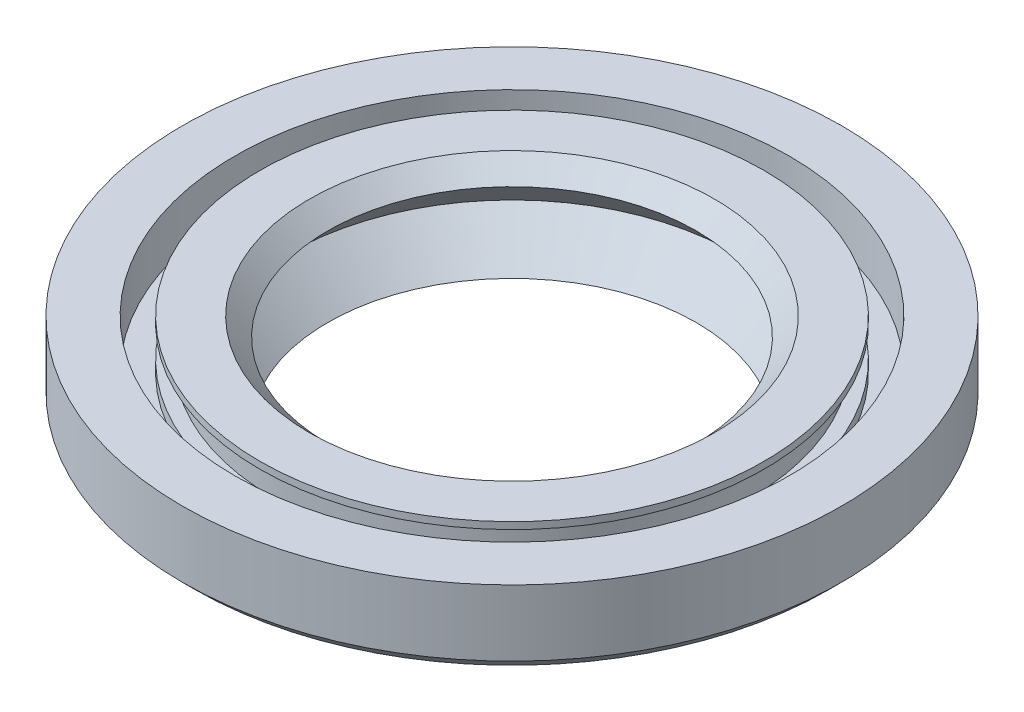
ISO-10303-21;
HEADER;
FILE_DESCRIPTION(('STEP AP214'),'2;1');
FILE_NAME('part.step','',(''),(''),'','','');
FILE_SCHEMA(('AUTOMOTIVE_DESIGN { 1 0 10303 214 1 1 1 1 }'));
ENDSEC;
DATA;
#1=APPLICATION_CONTEXT('core data for automotive mechanical design processes');
#2=APPLICATION_PROTOCOL_DEFINITION('international standard','automotive_design',2000,#1);
#3=PRODUCT_CONTEXT('',#1,'mechanical');
#4=PRODUCT('Part','Part','',(#3));
#5=PRODUCT_RELATED_PRODUCT_CATEGORY('part','',(#4));
#6=PRODUCT_DEFINITION_FORMATION('','',#4);
#7=PRODUCT_DEFINITION_CONTEXT('part definition',#1,'design');
#8=PRODUCT_DEFINITION('design','',#6,#7);
#9=PRODUCT_DEFINITION_SHAPE('','',#8);
#10=(LENGTH_UNIT() NAMED_UNIT(*) SI_UNIT(.MILLI.,.METRE.));
#11=(NAMED_UNIT(*) PLANE_ANGLE_UNIT() SI_UNIT($,.RADIAN.));
#12=(NAMED_UNIT(*) SI_UNIT($,.STERADIAN.) SOLID_ANGLE_UNIT());
#13=UNCERTAINTY_MEASURE_WITH_UNIT(LENGTH_MEASURE(1.E-05),#10,'distance_accuracy_value','');
#14=(GEOMETRIC_REPRESENTATION_CONTEXT(3) GLOBAL_UNCERTAINTY_ASSIGNED_CONTEXT((#13)) GLOBAL_UNIT_ASSIGNED_CONTEXT((#10,
#11,#12)) REPRESENTATION_CONTEXT('',''));
#15=CARTESIAN_POINT('',(0.,0.,0.));
#16=DIRECTION('',(0.,0.,1.));
#17=DIRECTION('',(1.,0.,0.));
#18=AXIS2_PLACEMENT_3D('',#15,#16,#17);
#19=CARTESIAN_POINT('',(0.,-1.22127685235368,0.));
#20=DIRECTION('',(0.,1.,0.));
#21=DIRECTION('',(0.,0.,1.));
#22=AXIS2_PLACEMENT_3D('',#19,#20,#21);
#23=CONICAL_SURFACE('',#22,11.5259526063671,0.774180610663883);
#24=CARTESIAN_POINT('',(0.,-3.29319951889741,0.));
#25=DIRECTION('',(0.,1.,0.));
#26=DIRECTION('',(0.,0.,1.));
#27=AXIS2_PLACEMENT_3D('',#24,#25,#26);
#28=CIRCLE('',#27,9.5);
#29=CARTESIAN_POINT('',(0.,-3.29319951889741,9.5));
#30=VERTEX_POINT('',#29);
#31=EDGE_CURVE('E10',#30,#30,#28,.T.);
#32=ORIENTED_EDGE('',*,*,#31,.F.);
#33=EDGE_LOOP('',(#32));
#34=FACE_BOUND('',#33,.T.);
#35=CARTESIAN_POINT('',(0.,-1.22127685235368,0.));
#36=DIRECTION('',(0.,1.,0.));
#37=DIRECTION('',(0.,0.,1.));
#38=AXIS2_PLACEMENT_3D('',#35,#36,#37);
#39=CIRCLE('',#38,11.5259526063671);
#40=CARTESIAN_POINT('',(0.,-1.22127685235368,11.5259526063671));
#41=VERTEX_POINT('',#40);
#42=EDGE_CURVE('E85',#41,#41,#39,.T.);
#43=ORIENTED_EDGE('',*,*,#42,.T.);
#44=EDGE_LOOP('',(#43));
#45=FACE_BOUND('',#44,.T.);
#46=ADVANCED_FACE('F30',(#34,#45),#23,.F.);
#47=CARTESIAN_POINT('',(0.,-3.29319951889741,0.));
#48=DIRECTION('',(0.,-1.,0.));
#49=DIRECTION('',(0.,0.,-1.));
#50=AXIS2_PLACEMENT_3D('',#47,#48,#49);
#51=CONICAL_SURFACE('',#50,9.5,1.45137891272772);
#52=CARTESIAN_POINT('',(0.,-3.59308306273926,0.));
#53=DIRECTION('',(0.,1.,0.));
#54=DIRECTION('',(0.,0.,1.));
#55=AXIS2_PLACEMENT_3D('',#52,#53,#54);
#56=CIRCLE('',#55,11.9992727468085);
#57=CARTESIAN_POINT('',(0.,-3.59308306273926,11.9992727468085));
#58=VERTEX_POINT('',#57);
#59=EDGE_CURVE('E36',#58,#58,#56,.T.);
#60=ORIENTED_EDGE('',*,*,#59,.F.);
#61=EDGE_LOOP('',(#60));
#62=FACE_BOUND('',#61,.T.);
#63=ORIENTED_EDGE('',*,*,#31,.T.);
#64=EDGE_LOOP('',(#63));
#65=FACE_BOUND('',#64,.T.);
#66=ADVANCED_FACE('F176',(#62,#65),#51,.F.);
#67=CARTESIAN_POINT('',(0.,-3.59308306273926,0.));
#68=DIRECTION('',(0.,1.,0.));
#69=DIRECTION('',(0.,0.,1.));
#70=AXIS2_PLACEMENT_3D('',#67,#68,#69);
#71=CONICAL_SURFACE('',#70,11.9992727468085,1.00720394930274);
#72=CARTESIAN_POINT('',(0.,-2.28382112157988,0.));
#73=DIRECTION('',(0.,1.,0.));
#74=DIRECTION('',(0.,0.,1.));
#75=AXIS2_PLACEMENT_3D('',#72,#73,#74);
#76=CIRCLE('',#75,14.0710035852234);
#77=CARTESIAN_POINT('',(0.,-2.28382112157988,14.0710035852234));
#78=VERTEX_POINT('',#77);
#79=EDGE_CURVE('E40',#78,#78,#76,.T.);
#80=ORIENTED_EDGE('',*,*,#79,.F.);
#81=EDGE_LOOP('',(#80));
#82=FACE_BOUND('',#81,.T.);
#83=ORIENTED_EDGE('',*,*,#59,.T.);
#84=EDGE_LOOP('',(#83));
#85=FACE_BOUND('',#84,.T.);
#86=ADVANCED_FACE('F171',(#82,#85),#71,.T.);
#87=CARTESIAN_POINT('',(16.3705936000076,-2.28382112157987,0.));
#88=DIRECTION('',(0.,1.,0.));
#89=DIRECTION('',(0.,0.,1.));
#90=AXIS2_PLACEMENT_3D('',#87,#88,#89);
#91=PLANE('',#90);
#92=CARTESIAN_POINT('',(0.,-2.28382112157988,0.));
#93=DIRECTION('',(0.,1.,0.));
#94=DIRECTION('',(0.,0.,1.));
#95=AXIS2_PLACEMENT_3D('',#92,#93,#94);
#96=CIRCLE('',#95,16.3705936000076);
#97=CARTESIAN_POINT('',(0.,-2.28382112157988,16.3705936000076));
#98=VERTEX_POINT('',#97);
#99=EDGE_CURVE('E44',#98,#98,#96,.T.);
#100=ORIENTED_EDGE('',*,*,#99,.F.);
#101=EDGE_LOOP('',(#100));
#102=FACE_BOUND('',#101,.T.);
#103=ORIENTED_EDGE('',*,*,#79,.T.);
#104=EDGE_LOOP('',(#103));
#105=FACE_BOUND('',#104,.T.);
#106=ADVANCED_FACE('F165',(#102,#105),#91,.F.);
#107=CARTESIAN_POINT('',(0.,-2.28382112157988,0.));
#108=DIRECTION('',(0.,1.,0.));
#109=DIRECTION('',(0.,0.,1.));
#110=AXIS2_PLACEMENT_3D('',#107,#108,#109);
#111=CONICAL_SURFACE('',#110,16.3705936000076,0.785398163397446);
#112=CARTESIAN_POINT('',(0.,-1.65441472158748,0.));
#113=DIRECTION('',(0.,1.,0.));
#114=DIRECTION('',(0.,0.,1.));
#115=AXIS2_PLACEMENT_3D('',#112,#113,#114);
#116=CIRCLE('',#115,17.);
#117=CARTESIAN_POINT('',(0.,-1.65441472158748,17.));
#118=VERTEX_POINT('',#117);
#119=EDGE_CURVE('E49',#118,#118,#116,.T.);
#120=ORIENTED_EDGE('',*,*,#119,.F.);
#121=EDGE_LOOP('',(#120));
#122=FACE_BOUND('',#121,.T.);
#123=ORIENTED_EDGE('',*,*,#99,.T.);
#124=EDGE_LOOP('',(#123));
#125=FACE_BOUND('',#124,.T.);
#126=ADVANCED_FACE('F159',(#122,#125),#111,.T.);
#127=CARTESIAN_POINT('',(0.,17.2087848331996,0.));
#128=DIRECTION('',(0.,1.,0.));
#129=DIRECTION('',(0.,0.,1.));
#130=AXIS2_PLACEMENT_3D('',#127,#128,#129);
#131=CYLINDRICAL_SURFACE('',#130,17.);
#132=CARTESIAN_POINT('',(0.,1.75029644571561,0.));
#133=DIRECTION('',(0.,1.,0.));
#134=DIRECTION('',(0.,0.,1.));
#135=AXIS2_PLACEMENT_3D('',#132,#133,#134);
#136=CIRCLE('',#135,17.);
#137=CARTESIAN_POINT('',(0.,1.75029644571561,17.));
#138=VERTEX_POINT('',#137);
#139=EDGE_CURVE('E52',#138,#138,#136,.T.);
#140=ORIENTED_EDGE('',*,*,#139,.F.);
#141=EDGE_LOOP('',(#140));
#142=FACE_BOUND('',#141,.T.);
#143=ORIENTED_EDGE('',*,*,#119,.T.);
#144=EDGE_LOOP('',(#143));
#145=FACE_BOUND('',#144,.T.);
#146=ADVANCED_FACE('F153',(#142,#145),#131,.T.);
#147=CARTESIAN_POINT('',(14.2944072960471,1.75029644571561,0.));
#148=DIRECTION('',(0.,-1.,0.));
#149=DIRECTION('',(0.,0.,-1.));
#150=AXIS2_PLACEMENT_3D('',#147,#148,#149);
#151=PLANE('',#150);
#152=CARTESIAN_POINT('',(0.,1.75029644571561,0.));
#153=DIRECTION('',(0.,1.,0.));
#154=DIRECTION('',(0.,0.,1.));
#155=AXIS2_PLACEMENT_3D('',#152,#153,#154);
#156=CIRCLE('',#155,14.2944072960471);
#157=CARTESIAN_POINT('',(0.,1.75029644571561,14.2944072960471));
#158=VERTEX_POINT('',#157);
#159=EDGE_CURVE('E55',#158,#158,#156,.T.);
#160=ORIENTED_EDGE('',*,*,#159,.F.);
#161=EDGE_LOOP('',(#160));
#162=FACE_BOUND('',#161,.T.);
#163=ORIENTED_EDGE('',*,*,#139,.T.);
#164=EDGE_LOOP('',(#163));
#165=FACE_BOUND('',#164,.T.);
#166=ADVANCED_FACE('F147',(#162,#165),#151,.F.);
#167=CARTESIAN_POINT('',(0.,17.2087848331996,0.));
#168=DIRECTION('',(0.,1.,0.));
#169=DIRECTION('',(0.,0.,1.));
#170=AXIS2_PLACEMENT_3D('',#167,#168,#169);
#171=CYLINDRICAL_SURFACE('',#170,14.2944072960471);
#172=CARTESIAN_POINT('',(0.,-0.78508260676553,0.));
#173=DIRECTION('',(0.,1.,0.));
#174=DIRECTION('',(0.,0.,1.));
#175=AXIS2_PLACEMENT_3D('',#172,#173,#174);
#176=CIRCLE('',#175,14.2944072960471);
#177=CARTESIAN_POINT('',(0.,-0.78508260676553,14.2944072960471));
#178=VERTEX_POINT('',#177);
#179=EDGE_CURVE('E58',#178,#178,#176,.T.);
#180=ORIENTED_EDGE('',*,*,#179,.F.);
#181=EDGE_LOOP('',(#180));
#182=FACE_BOUND('',#181,.T.);
#183=ORIENTED_EDGE('',*,*,#159,.T.);
#184=EDGE_LOOP('',(#183));
#185=FACE_BOUND('',#184,.T.);
#186=ADVANCED_FACE('F141',(#182,#185),#171,.F.);
#187=CARTESIAN_POINT('',(13.,-0.78508260676553,0.));
#188=DIRECTION('',(0.,-1.,0.));
#189=DIRECTION('',(0.,0.,-1.));
#190=AXIS2_PLACEMENT_3D('',#187,#188,#189);
#191=PLANE('',#190);
#192=CARTESIAN_POINT('',(0.,-0.78508260676553,0.));
#193=DIRECTION('',(0.,1.,0.));
#194=DIRECTION('',(0.,0.,1.));
#195=AXIS2_PLACEMENT_3D('',#192,#193,#194);
#196=CIRCLE('',#195,13.);
#197=CARTESIAN_POINT('',(0.,-0.78508260676553,13.));
#198=VERTEX_POINT('',#197);
#199=EDGE_CURVE('E61',#198,#198,#196,.T.);
#200=ORIENTED_EDGE('',*,*,#199,.F.);
#201=EDGE_LOOP('',(#200));
#202=FACE_BOUND('',#201,.T.);
#203=ORIENTED_EDGE('',*,*,#179,.T.);
#204=EDGE_LOOP('',(#203));
#205=FACE_BOUND('',#204,.T.);
#206=ADVANCED_FACE('F135',(#202,#205),#191,.F.);
#207=CARTESIAN_POINT('',(0.,17.2087848331996,0.));
#208=DIRECTION('',(0.,1.,0.));
#209=DIRECTION('',(0.,0.,1.));
#210=AXIS2_PLACEMENT_3D('',#207,#208,#209);
#211=CYLINDRICAL_SURFACE('',#210,13.);
#212=CARTESIAN_POINT('',(0.,-0.208300549170145,0.));
#213=DIRECTION('',(0.,1.,0.));
#214=DIRECTION('',(0.,0.,1.));
#215=AXIS2_PLACEMENT_3D('',#212,#213,#214);
#216=CIRCLE('',#215,13.);
#217=CARTESIAN_POINT('',(0.,-0.208300549170145,13.));
#218=VERTEX_POINT('',#217);
#219=EDGE_CURVE('E64',#218,#218,#216,.T.);
#220=ORIENTED_EDGE('',*,*,#219,.F.);
#221=EDGE_LOOP('',(#220));
#222=FACE_BOUND('',#221,.T.);
#223=ORIENTED_EDGE('',*,*,#199,.T.);
#224=EDGE_LOOP('',(#223));
#225=FACE_BOUND('',#224,.T.);
#226=ADVANCED_FACE('F129',(#222,#225),#211,.T.);
#227=CARTESIAN_POINT('',(12.3164572927732,-0.208300549170146,0.));
#228=DIRECTION('',(0.,-1.,0.));
#229=DIRECTION('',(0.,0.,-1.));
#230=AXIS2_PLACEMENT_3D('',#227,#228,#229);
#231=PLANE('',#230);
#232=CARTESIAN_POINT('',(0.,-0.208300549170145,0.));
#233=DIRECTION('',(0.,1.,0.));
#234=DIRECTION('',(0.,0.,1.));
#235=AXIS2_PLACEMENT_3D('',#232,#233,#234);
#236=CIRCLE('',#235,12.3164572927732);
#237=CARTESIAN_POINT('',(0.,-0.208300549170145,12.3164572927732));
#238=VERTEX_POINT('',#237);
#239=EDGE_CURVE('E67',#238,#238,#236,.T.);
#240=ORIENTED_EDGE('',*,*,#239,.F.);
#241=EDGE_LOOP('',(#240));
#242=FACE_BOUND('',#241,.T.);
#243=ORIENTED_EDGE('',*,*,#219,.T.);
#244=EDGE_LOOP('',(#243));
#245=FACE_BOUND('',#244,.T.);
#246=ADVANCED_FACE('F123',(#242,#245),#231,.F.);
#247=CARTESIAN_POINT('',(0.,17.2087848331996,0.));
#248=DIRECTION('',(0.,1.,0.));
#249=DIRECTION('',(0.,0.,1.));
#250=AXIS2_PLACEMENT_3D('',#247,#248,#249);
#251=CYLINDRICAL_SURFACE('',#250,12.3164572927732);
#252=CARTESIAN_POINT('',(0.,1.39588862117523,0.));
#253=DIRECTION('',(0.,1.,0.));
#254=DIRECTION('',(0.,0.,1.));
#255=AXIS2_PLACEMENT_3D('',#252,#253,#254);
#256=CIRCLE('',#255,12.3164572927732);
#257=CARTESIAN_POINT('',(0.,1.39588862117523,12.3164572927732));
#258=VERTEX_POINT('',#257);
#259=EDGE_CURVE('E70',#258,#258,#256,.T.);
#260=ORIENTED_EDGE('',*,*,#259,.F.);
#261=EDGE_LOOP('',(#260));
#262=FACE_BOUND('',#261,.T.);
#263=ORIENTED_EDGE('',*,*,#239,.T.);
#264=EDGE_LOOP('',(#263));
#265=FACE_BOUND('',#264,.T.);
#266=ADVANCED_FACE('F117',(#262,#265),#251,.T.);
#267=CARTESIAN_POINT('',(13.,1.39588862117524,0.));
#268=DIRECTION('',(0.,1.,0.));
#269=DIRECTION('',(0.,0.,1.));
#270=AXIS2_PLACEMENT_3D('',#267,#268,#269);
#271=PLANE('',#270);
#272=CARTESIAN_POINT('',(0.,1.39588862117523,0.));
#273=DIRECTION('',(0.,1.,0.));
#274=DIRECTION('',(0.,0.,1.));
#275=AXIS2_PLACEMENT_3D('',#272,#273,#274);
#276=CIRCLE('',#275,13.);
#277=CARTESIAN_POINT('',(0.,1.39588862117523,13.));
#278=VERTEX_POINT('',#277);
#279=EDGE_CURVE('E73',#278,#278,#276,.T.);
#280=ORIENTED_EDGE('',*,*,#279,.F.);
#281=EDGE_LOOP('',(#280));
#282=FACE_BOUND('',#281,.T.);
#283=ORIENTED_EDGE('',*,*,#259,.T.);
#284=EDGE_LOOP('',(#283));
#285=FACE_BOUND('',#284,.T.);
#286=ADVANCED_FACE('F111',(#282,#285),#271,.F.);
#287=CARTESIAN_POINT('',(0.,17.2087848331996,0.));
#288=DIRECTION('',(0.,1.,0.));
#289=DIRECTION('',(0.,0.,1.));
#290=AXIS2_PLACEMENT_3D('',#287,#288,#289);
#291=CYLINDRICAL_SURFACE('',#290,13.);
#292=CARTESIAN_POINT('',(0.,1.75029644571561,0.));
#293=DIRECTION('',(0.,1.,0.));
#294=DIRECTION('',(0.,0.,1.));
#295=AXIS2_PLACEMENT_3D('',#292,#293,#294);
#296=CIRCLE('',#295,13.);
#297=CARTESIAN_POINT('',(0.,1.75029644571561,13.));
#298=VERTEX_POINT('',#297);
#299=EDGE_CURVE('E76',#298,#298,#296,.T.);
#300=ORIENTED_EDGE('',*,*,#299,.F.);
#301=EDGE_LOOP('',(#300));
#302=FACE_BOUND('',#301,.T.);
#303=ORIENTED_EDGE('',*,*,#279,.T.);
#304=EDGE_LOOP('',(#303));
#305=FACE_BOUND('',#304,.T.);
#306=ADVANCED_FACE('F105',(#302,#305),#291,.T.);
#307=CARTESIAN_POINT('',(10.4456206917022,1.75029644571561,0.));
#308=DIRECTION('',(0.,-1.,0.));
#309=DIRECTION('',(0.,0.,-1.));
#310=AXIS2_PLACEMENT_3D('',#307,#308,#309);
#311=PLANE('',#310);
#312=CARTESIAN_POINT('',(0.,1.75029644571561,0.));
#313=DIRECTION('',(0.,1.,0.));
#314=DIRECTION('',(0.,0.,1.));
#315=AXIS2_PLACEMENT_3D('',#312,#313,#314);
#316=CIRCLE('',#315,10.4456206917022);
#317=CARTESIAN_POINT('',(0.,1.75029644571561,10.4456206917022));
#318=VERTEX_POINT('',#317);
#319=EDGE_CURVE('E79',#318,#318,#316,.T.);
#320=ORIENTED_EDGE('',*,*,#319,.F.);
#321=EDGE_LOOP('',(#320));
#322=FACE_BOUND('',#321,.T.);
#323=ORIENTED_EDGE('',*,*,#299,.T.);
#324=EDGE_LOOP('',(#323));
#325=FACE_BOUND('',#324,.T.);
#326=ADVANCED_FACE('F99',(#322,#325),#311,.F.);
#327=CARTESIAN_POINT('',(0.,1.75029644571561,0.));
#328=DIRECTION('',(0.,1.,0.));
#329=DIRECTION('',(0.,0.,1.));
#330=AXIS2_PLACEMENT_3D('',#327,#328,#329);
#331=CONICAL_SURFACE('',#330,10.4456206917022,0.785398163397448);
#332=CARTESIAN_POINT('',(0.,0.804675754013391,0.));
#333=DIRECTION('',(0.,1.,0.));
#334=DIRECTION('',(0.,0.,1.));
#335=AXIS2_PLACEMENT_3D('',#332,#333,#334);
#336=CIRCLE('',#335,9.5);
#337=CARTESIAN_POINT('',(0.,0.804675754013391,9.5));
#338=VERTEX_POINT('',#337);
#339=EDGE_CURVE('E82',#338,#338,#336,.T.);
#340=ORIENTED_EDGE('',*,*,#339,.F.);
#341=EDGE_LOOP('',(#340));
#342=FACE_BOUND('',#341,.T.);
#343=ORIENTED_EDGE('',*,*,#319,.T.);
#344=EDGE_LOOP('',(#343));
#345=FACE_BOUND('',#344,.T.);
#346=ADVANCED_FACE('F93',(#342,#345),#331,.F.);
#347=CARTESIAN_POINT('',(0.,0.804675754013391,0.));
#348=DIRECTION('',(0.,-1.,0.));
#349=DIRECTION('',(0.,0.,-1.));
#350=AXIS2_PLACEMENT_3D('',#347,#348,#349);
#351=CONICAL_SURFACE('',#350,9.5,0.785398163397449);
#352=ORIENTED_EDGE('',*,*,#42,.F.);
#353=EDGE_LOOP('',(#352));
#354=FACE_BOUND('',#353,.T.);
#355=ORIENTED_EDGE('',*,*,#339,.T.);
#356=EDGE_LOOP('',(#355));
#357=FACE_BOUND('',#356,.T.);
#358=ADVANCED_FACE('F90',(#354,#357),#351,.F.);
#359=CLOSED_SHELL('',(#46,#66,#86,#106,#126,#146,#166,#186,#206,#226,#246,#266,#286,#306,#326,
#346,#358));
#360=MANIFOLD_SOLID_BREP('B2',#359);
#361=ADVANCED_BREP_SHAPE_REPRESENTATION('',(#18,#360),#14);
#362=SHAPE_DEFINITION_REPRESENTATION(#9,#361);
ENDSEC;
END-ISO-10303-21;
